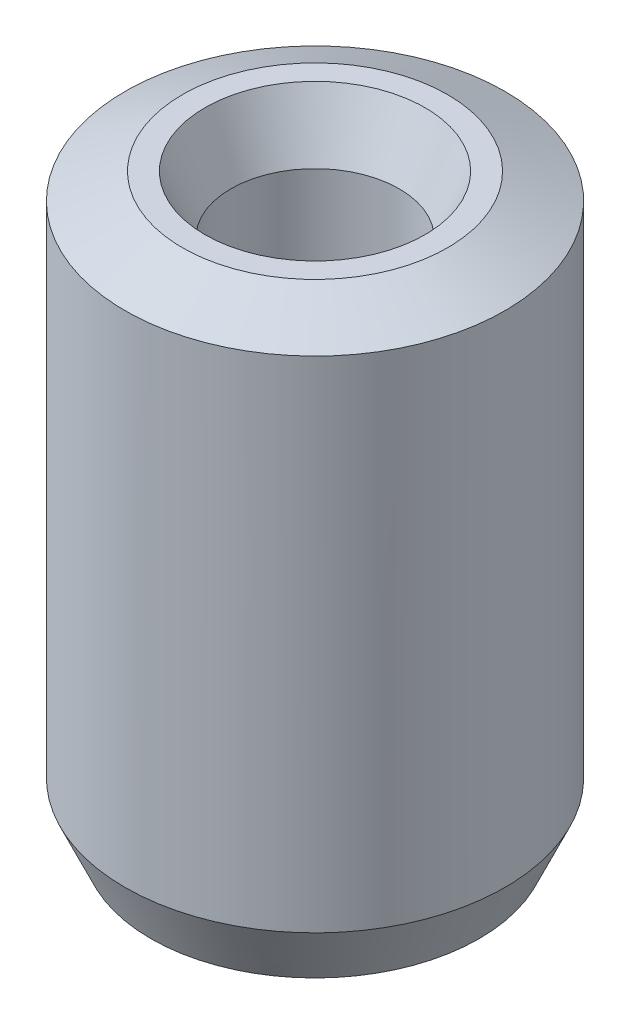
ISO-10303-21;
HEADER;
FILE_DESCRIPTION(('STEP AP214'),'2;1');
FILE_NAME('part.step','',(''),(''),'','','');
FILE_SCHEMA(('AUTOMOTIVE_DESIGN { 1 0 10303 214 1 1 1 1 }'));
ENDSEC;
DATA;
#1=APPLICATION_CONTEXT('core data for automotive mechanical design processes');
#2=APPLICATION_PROTOCOL_DEFINITION('international standard','automotive_design',2000,#1);
#3=PRODUCT_CONTEXT('',#1,'mechanical');
#4=PRODUCT('Part','Part','',(#3));
#5=PRODUCT_RELATED_PRODUCT_CATEGORY('part','',(#4));
#6=PRODUCT_DEFINITION_FORMATION('','',#4);
#7=PRODUCT_DEFINITION_CONTEXT('part definition',#1,'design');
#8=PRODUCT_DEFINITION('design','',#6,#7);
#9=PRODUCT_DEFINITION_SHAPE('','',#8);
#10=(LENGTH_UNIT() NAMED_UNIT(*) SI_UNIT(.MILLI.,.METRE.));
#11=(NAMED_UNIT(*) PLANE_ANGLE_UNIT() SI_UNIT($,.RADIAN.));
#12=(NAMED_UNIT(*) SI_UNIT($,.STERADIAN.) SOLID_ANGLE_UNIT());
#13=UNCERTAINTY_MEASURE_WITH_UNIT(LENGTH_MEASURE(1.E-05),#10,'distance_accuracy_value','');
#14=(GEOMETRIC_REPRESENTATION_CONTEXT(3) GLOBAL_UNCERTAINTY_ASSIGNED_CONTEXT((#13)) GLOBAL_UNIT_ASSIGNED_CONTEXT((#10,
#11,#12)) REPRESENTATION_CONTEXT('',''));
#15=CARTESIAN_POINT('',(0.,0.,0.));
#16=DIRECTION('',(0.,0.,1.));
#17=DIRECTION('',(1.,0.,0.));
#18=AXIS2_PLACEMENT_3D('',#15,#16,#17);
#19=CARTESIAN_POINT('',(0.,84.3537558996951,0.));
#20=DIRECTION('',(0.,-1.,0.));
#21=DIRECTION('',(0.,0.,-1.));
#22=AXIS2_PLACEMENT_3D('',#19,#20,#21);
#23=CYLINDRICAL_SURFACE('',#22,27.5);
#24=CARTESIAN_POINT('',(0.,8.29972185055879,0.));
#25=DIRECTION('',(0.,1.,0.));
#26=DIRECTION('',(0.,0.,1.));
#27=AXIS2_PLACEMENT_3D('',#24,#25,#26);
#28=CIRCLE('',#27,27.5);
#29=CARTESIAN_POINT('',(0.,8.29972185055879,27.5));
#30=VERTEX_POINT('',#29);
#31=EDGE_CURVE('E10',#30,#30,#28,.T.);
#32=ORIENTED_EDGE('',*,*,#31,.T.);
#33=EDGE_LOOP('',(#32));
#34=FACE_BOUND('',#33,.T.);
#35=CARTESIAN_POINT('',(0.,80.6112224634863,0.));
#36=DIRECTION('',(0.,1.,0.));
#37=DIRECTION('',(0.,0.,1.));
#38=AXIS2_PLACEMENT_3D('',#35,#36,#37);
#39=CIRCLE('',#38,27.5);
#40=CARTESIAN_POINT('',(0.,80.6112224634863,-27.5));
#41=VERTEX_POINT('',#40);
#42=EDGE_CURVE('E50',#41,#41,#39,.F.);
#43=ORIENTED_EDGE('',*,*,#42,.T.);
#44=EDGE_LOOP('',(#43));
#45=FACE_BOUND('',#44,.T.);
#46=ADVANCED_FACE('F39',(#34,#45),#23,.T.);
#47=CARTESIAN_POINT('',(0.,84.3537558996951,0.));
#48=DIRECTION('',(0.,1.,0.));
#49=DIRECTION('',(0.,0.,1.));
#50=AXIS2_PLACEMENT_3D('',#47,#48,#49);
#51=PLANE('',#50);
#52=CARTESIAN_POINT('',(0.,84.3537558996951,0.));
#53=DIRECTION('',(0.,1.,0.));
#54=DIRECTION('',(0.,0.,1.));
#55=AXIS2_PLACEMENT_3D('',#52,#53,#54);
#56=CIRCLE('',#55,15.9318125522264);
#57=CARTESIAN_POINT('',(0.,84.3537558996951,15.9318125522264));
#58=VERTEX_POINT('',#57);
#59=EDGE_CURVE('E58',#58,#58,#56,.F.);
#60=ORIENTED_EDGE('',*,*,#59,.T.);
#61=EDGE_LOOP('',(#60));
#62=FACE_BOUND('',#61,.T.);
#63=CARTESIAN_POINT('',(0.,84.3537558996951,0.));
#64=DIRECTION('',(0.,1.,0.));
#65=DIRECTION('',(0.,0.,1.));
#66=AXIS2_PLACEMENT_3D('',#63,#64,#65);
#67=CIRCLE('',#66,19.2002781494412);
#68=CARTESIAN_POINT('',(0.,84.3537558996951,-19.2002781494412));
#69=VERTEX_POINT('',#68);
#70=EDGE_CURVE('E61',#69,#69,#67,.T.);
#71=ORIENTED_EDGE('',*,*,#70,.T.);
#72=EDGE_LOOP('',(#71));
#73=FACE_BOUND('',#72,.T.);
#74=ADVANCED_FACE('F88',(#62,#73),#51,.T.);
#75=CARTESIAN_POINT('',(0.,0.,0.));
#76=DIRECTION('',(0.,1.,0.));
#77=DIRECTION('',(0.,0.,1.));
#78=AXIS2_PLACEMENT_3D('',#75,#76,#77);
#79=PLANE('',#78);
#80=CARTESIAN_POINT('',(0.,0.,0.));
#81=DIRECTION('',(0.,1.,0.));
#82=DIRECTION('',(0.,0.,1.));
#83=AXIS2_PLACEMENT_3D('',#80,#81,#82);
#84=CIRCLE('',#83,20.4890009665764);
#85=CARTESIAN_POINT('',(0.,0.,-20.4890009665764));
#86=VERTEX_POINT('',#85);
#87=EDGE_CURVE('E51',#86,#86,#84,.T.);
#88=ORIENTED_EDGE('',*,*,#87,.T.);
#89=EDGE_LOOP('',(#88));
#90=FACE_BOUND('',#89,.T.);
#91=CARTESIAN_POINT('',(0.,0.,0.));
#92=DIRECTION('',(0.,1.,0.));
#93=DIRECTION('',(0.,0.,1.));
#94=AXIS2_PLACEMENT_3D('',#91,#92,#93);
#95=CIRCLE('',#94,23.7574665637912);
#96=CARTESIAN_POINT('',(0.,0.,23.7574665637912));
#97=VERTEX_POINT('',#96);
#98=EDGE_CURVE('E54',#97,#97,#95,.F.);
#99=ORIENTED_EDGE('',*,*,#98,.T.);
#100=EDGE_LOOP('',(#99));
#101=FACE_BOUND('',#100,.T.);
#102=ADVANCED_FACE('F83',(#90,#101),#79,.F.);
#103=CARTESIAN_POINT('',(0.,84.3537558996951,0.));
#104=DIRECTION('',(0.,-1.,0.));
#105=DIRECTION('',(0.,0.,-1.));
#106=AXIS2_PLACEMENT_3D('',#103,#104,#105);
#107=CYLINDRICAL_SURFACE('',#106,12.1892791160176);
#108=CARTESIAN_POINT('',(0.,76.0540340491363,0.));
#109=DIRECTION('',(0.,1.,0.));
#110=DIRECTION('',(0.,0.,1.));
#111=AXIS2_PLACEMENT_3D('',#108,#109,#110);
#112=CIRCLE('',#111,12.1892791160176);
#113=CARTESIAN_POINT('',(0.,76.0540340491363,12.1892791160176));
#114=VERTEX_POINT('',#113);
#115=EDGE_CURVE('E67',#114,#114,#112,.T.);
#116=ORIENTED_EDGE('',*,*,#115,.T.);
#117=EDGE_LOOP('',(#116));
#118=FACE_BOUND('',#117,.T.);
#119=CARTESIAN_POINT('',(0.,3.7425334362088,0.));
#120=DIRECTION('',(0.,1.,0.));
#121=DIRECTION('',(0.,0.,1.));
#122=AXIS2_PLACEMENT_3D('',#119,#120,#121);
#123=CIRCLE('',#122,12.1892791160176);
#124=CARTESIAN_POINT('',(0.,3.7425334362088,-12.1892791160176));
#125=VERTEX_POINT('',#124);
#126=EDGE_CURVE('E69',#125,#125,#123,.F.);
#127=ORIENTED_EDGE('',*,*,#126,.T.);
#128=EDGE_LOOP('',(#127));
#129=FACE_BOUND('',#128,.T.);
#130=ADVANCED_FACE('F71',(#118,#129),#107,.F.);
#131=CARTESIAN_POINT('',(0.,76.0540340491363,0.));
#132=DIRECTION('',(0.,1.,0.));
#133=DIRECTION('',(0.,0.,1.));
#134=AXIS2_PLACEMENT_3D('',#131,#132,#133);
#135=CONICAL_SURFACE('',#134,12.1892791160176,0.423621024279355);
#136=ORIENTED_EDGE('',*,*,#59,.F.);
#137=EDGE_LOOP('',(#136));
#138=FACE_BOUND('',#137,.T.);
#139=ORIENTED_EDGE('',*,*,#115,.F.);
#140=EDGE_LOOP('',(#139));
#141=FACE_BOUND('',#140,.T.);
#142=ADVANCED_FACE('F77',(#138,#141),#135,.F.);
#143=CARTESIAN_POINT('',(0.,0.,0.));
#144=DIRECTION('',(0.,-1.,0.));
#145=DIRECTION('',(0.,0.,-1.));
#146=AXIS2_PLACEMENT_3D('',#143,#144,#145);
#147=CONICAL_SURFACE('',#146,20.4890009665764,1.14717530251554);
#148=CARTESIAN_POINT('',(0.,3.7425334362088,-12.1892791160176));
#149=CARTESIAN_POINT('',(0.,3.70354871291496,-12.2757345519609));
#150=CARTESIAN_POINT('',(0.,3.66456398962111,-12.3621899879042));
#151=CARTESIAN_POINT('',(0.,3.58659454303343,-12.5351008597909));
#152=CARTESIAN_POINT('',(0.,3.54760981973959,-12.6215562957342));
#153=CARTESIAN_POINT('',(0.,3.46964037315191,-12.7944671676208));
#154=CARTESIAN_POINT('',(0.,3.43065564985806,-12.8809226035641));
#155=CARTESIAN_POINT('',(0.,3.35268620327038,-13.0538334754508));
#156=CARTESIAN_POINT('',(0.,3.31370147997654,-13.1402889113941));
#157=CARTESIAN_POINT('',(0.,3.23573203338886,-13.3131997832807));
#158=CARTESIAN_POINT('',(0.,3.19674731009501,-13.3996552192241));
#159=CARTESIAN_POINT('',(0.,3.11877786350733,-13.5725660911107));
#160=CARTESIAN_POINT('',(0.,3.07979314021349,-13.659021527054));
#161=CARTESIAN_POINT('',(0.,3.00182369362581,-13.8319323989407));
#162=CARTESIAN_POINT('',(0.,2.96283897033196,-13.918387834884));
#163=CARTESIAN_POINT('',(0.,2.88486952374428,-14.0912987067706));
#164=CARTESIAN_POINT('',(0.,2.84588480045044,-14.177754142714));
#165=CARTESIAN_POINT('',(0.,2.76791535386276,-14.3506650146006));
#166=CARTESIAN_POINT('',(0.,2.72893063056891,-14.4371204505439));
#167=CARTESIAN_POINT('',(0.,2.65096118398123,-14.6100313224306));
#168=CARTESIAN_POINT('',(0.,2.61197646068739,-14.6964867583739));
#169=CARTESIAN_POINT('',(0.,2.53400701409971,-14.8693976302605));
#170=CARTESIAN_POINT('',(0.,2.49502229080586,-14.9558530662038));
#171=CARTESIAN_POINT('',(0.,2.41705284421818,-15.1287639380905));
#172=CARTESIAN_POINT('',(0.,2.37806812092434,-15.2152193740338));
#173=CARTESIAN_POINT('',(0.,2.30009867433666,-15.3881302459204));
#174=CARTESIAN_POINT('',(0.,2.26111395104281,-15.4745856818638));
#175=CARTESIAN_POINT('',(0.,2.18314450445513,-15.6474965537504));
#176=CARTESIAN_POINT('',(0.,2.14415978116129,-15.7339519896937));
#177=CARTESIAN_POINT('',(0.,2.06619033457361,-15.9068628615804));
#178=CARTESIAN_POINT('',(0.,2.02720561127977,-15.9933182975237));
#179=CARTESIAN_POINT('',(0.,1.94923616469208,-16.1662291694103));
#180=CARTESIAN_POINT('',(0.,1.91025144139824,-16.2526846053537));
#181=CARTESIAN_POINT('',(0.,1.83228199481056,-16.4255954772403));
#182=CARTESIAN_POINT('',(0.,1.79329727151672,-16.5120509131836));
#183=CARTESIAN_POINT('',(0.,1.71532782492903,-16.6849617850703));
#184=CARTESIAN_POINT('',(0.,1.67634310163519,-16.7714172210136));
#185=CARTESIAN_POINT('',(0.,1.59837365504751,-16.9443280929002));
#186=CARTESIAN_POINT('',(0.,1.55938893175367,-17.0307835288435));
#187=CARTESIAN_POINT('',(0.,1.48141948516598,-17.2036944007302));
#188=CARTESIAN_POINT('',(0.,1.44243476187214,-17.2901498366735));
#189=CARTESIAN_POINT('',(0.,1.36446531528446,-17.4630607085601));
#190=CARTESIAN_POINT('',(0.,1.32548059199062,-17.5495161445035));
#191=CARTESIAN_POINT('',(0.,1.24751114540293,-17.7224270163901));
#192=CARTESIAN_POINT('',(0.,1.20852642210909,-17.8088824523334));
#193=CARTESIAN_POINT('',(0.,1.13055697552141,-17.9817933242201));
#194=CARTESIAN_POINT('',(0.,1.09157225222757,-18.0682487601634));
#195=CARTESIAN_POINT('',(0.,1.01360280563988,-18.24115963205));
#196=CARTESIAN_POINT('',(0.,0.974618082346041,-18.3276150679933));
#197=CARTESIAN_POINT('',(0.,0.896648635758358,-18.50052593988));
#198=CARTESIAN_POINT('',(0.,0.857663912464516,-18.5869813758233));
#199=CARTESIAN_POINT('',(0.,0.779694465876832,-18.75989224771));
#200=CARTESIAN_POINT('',(0.,0.740709742582991,-18.8463476836533));
#201=CARTESIAN_POINT('',(0.,0.662740295995308,-19.0192585555399));
#202=CARTESIAN_POINT('',(0.,0.623755572701466,-19.1057139914832));
#203=CARTESIAN_POINT('',(0.,0.545786126113783,-19.2786248633699));
#204=CARTESIAN_POINT('',(0.,0.506801402819941,-19.3650802993132));
#205=CARTESIAN_POINT('',(0.,0.428831956232258,-19.5379911711998));
#206=CARTESIAN_POINT('',(0.,0.389847232938416,-19.6244466071432));
#207=CARTESIAN_POINT('',(0.,0.311877786350733,-19.7973574790298));
#208=CARTESIAN_POINT('',(0.,0.272893063056892,-19.8838129149731));
#209=CARTESIAN_POINT('',(0.,0.194923616469208,-20.0567237868598));
#210=CARTESIAN_POINT('',(0.,0.155938893175367,-20.1431792228031));
#211=CARTESIAN_POINT('',(0.,0.0779694465876828,-20.3160900946897));
#212=CARTESIAN_POINT('',(0.,0.0389847232938409,-20.402545530633));
#213=CARTESIAN_POINT('',(0.,0.,-20.4890009665764));
#214=B_SPLINE_CURVE_WITH_KNOTS('',3,(#148,#149,#150,#151,#152,#153,#154,#155,#156,#157,#158,
#159,#160,#161,#162,#163,#164,#165,#166,#167,#168,#169,#170,#171,#172,#173,#174,#175,#176,#177,
#178,#179,#180,#181,#182,#183,#184,#185,#186,#187,#188,#189,#190,#191,#192,#193,#194,#195,#196,
#197,#198,#199,#200,#201,#202,#203,#204,#205,#206,#207,#208,#209,#210,#211,#212,#213),
.UNSPECIFIED.,.F.,.F.,(4,2,2,2,2,2,2,2,2,2,2,2,2,2,2,2,2,2,2,2,2,2,2,2,2,2,2,2,2,2,2,2,4),(0.,
0.284515657723831,0.56903131544766,0.85354697317149,1.13806263089532,1.42257828861915,
1.70709394634298,1.99160960406681,2.27612526179064,2.56064091951447,2.8451565772383,
3.12967223496213,3.41418789268596,3.69870355040978,3.98321920813361,4.26773486585744,
4.55225052358127,4.8367661813051,5.12128183902893,5.40579749675276,5.69031315447659,
5.97482881220042,6.25934446992425,6.54386012764808,6.82837578537191,7.11289144309574,
7.39740710081957,7.6819227585434,7.96643841626722,8.25095407399105,8.53546973171489,
8.81998538943871,9.10450104716254),.UNSPECIFIED.);
#215=EDGE_CURVE('BSEAM73',#125,#86,#214,.T.);
#216=ORIENTED_EDGE('',*,*,#126,.F.);
#217=ORIENTED_EDGE('',*,*,#87,.F.);
#218=ORIENTED_EDGE('',*,*,#215,.T.);
#219=ORIENTED_EDGE('',*,*,#215,.F.);
#220=EDGE_LOOP('',(#216,#218,#217,#219));
#221=FACE_BOUND('',#220,.T.);
#222=ADVANCED_FACE('F73',(#221),#147,.F.);
#223=CARTESIAN_POINT('',(0.,8.29972185055879,0.));
#224=DIRECTION('',(0.,1.,0.));
#225=DIRECTION('',(0.,0.,1.));
#226=AXIS2_PLACEMENT_3D('',#223,#224,#225);
#227=CONICAL_SURFACE('',#226,27.5,0.423621024279354);
#228=ORIENTED_EDGE('',*,*,#98,.F.);
#229=EDGE_LOOP('',(#228));
#230=FACE_BOUND('',#229,.T.);
#231=ORIENTED_EDGE('',*,*,#31,.F.);
#232=EDGE_LOOP('',(#231));
#233=FACE_BOUND('',#232,.T.);
#234=ADVANCED_FACE('F76',(#230,#233),#227,.T.);
#235=CARTESIAN_POINT('',(0.,84.3537558996951,0.));
#236=DIRECTION('',(0.,-1.,0.));
#237=DIRECTION('',(0.,0.,-1.));
#238=AXIS2_PLACEMENT_3D('',#235,#236,#237);
#239=CONICAL_SURFACE('',#238,19.2002781494412,1.14717530251554);
#240=CARTESIAN_POINT('',(0.,80.6112224634863,-27.5));
#241=CARTESIAN_POINT('',(0.,80.6502071867801,-27.4135445640567));
#242=CARTESIAN_POINT('',(0.,80.689191910074,-27.3270891281134));
#243=CARTESIAN_POINT('',(0.,80.7671613566617,-27.1541782562267));
#244=CARTESIAN_POINT('',(0.,80.8061460799555,-27.0677228202834));
#245=CARTESIAN_POINT('',(0.,80.8841155265432,-26.8948119483968));
#246=CARTESIAN_POINT('',(0.,80.923100249837,-26.8083565124535));
#247=CARTESIAN_POINT('',(0.,81.0010696964247,-26.6354456405668));
#248=CARTESIAN_POINT('',(0.,81.0400544197186,-26.5489902046235));
#249=CARTESIAN_POINT('',(0.,81.1180238663062,-26.3760793327369));
#250=CARTESIAN_POINT('',(0.,81.1570085896001,-26.2896238967935));
#251=CARTESIAN_POINT('',(0.,81.2349780361877,-26.1167130249069));
#252=CARTESIAN_POINT('',(0.,81.2739627594816,-26.0302575889636));
#253=CARTESIAN_POINT('',(0.,81.3519322060693,-25.8573467170769));
#254=CARTESIAN_POINT('',(0.,81.3909169293631,-25.7708912811336));
#255=CARTESIAN_POINT('',(0.,81.4688863759508,-25.597980409247));
#256=CARTESIAN_POINT('',(0.,81.5078710992447,-25.5115249733036));
#257=CARTESIAN_POINT('',(0.,81.5858405458323,-25.338614101417));
#258=CARTESIAN_POINT('',(0.,81.6248252691262,-25.2521586654737));
#259=CARTESIAN_POINT('',(0.,81.7027947157139,-25.079247793587));
#260=CARTESIAN_POINT('',(0.,81.7417794390077,-24.9927923576437));
#261=CARTESIAN_POINT('',(0.,81.8197488855954,-24.8198814857571));
#262=CARTESIAN_POINT('',(0.,81.8587336088892,-24.7334260498138));
#263=CARTESIAN_POINT('',(0.,81.9367030554769,-24.5605151779271));
#264=CARTESIAN_POINT('',(0.,81.9756877787707,-24.4740597419838));
#265=CARTESIAN_POINT('',(0.,82.0536572253584,-24.3011488700971));
#266=CARTESIAN_POINT('',(0.,82.0926419486523,-24.2146934341538));
#267=CARTESIAN_POINT('',(0.,82.17061139524,-24.0417825622672));
#268=CARTESIAN_POINT('',(0.,82.2095961185338,-23.9553271263239));
#269=CARTESIAN_POINT('',(0.,82.2875655651215,-23.7824162544372));
#270=CARTESIAN_POINT('',(0.,82.3265502884153,-23.6959608184939));
#271=CARTESIAN_POINT('',(0.,82.404519735003,-23.5230499466073));
#272=CARTESIAN_POINT('',(0.,82.4435044582968,-23.4365945106639));
#273=CARTESIAN_POINT('',(0.,82.5214739048845,-23.2636836387773));
#274=CARTESIAN_POINT('',(0.,82.5604586281784,-23.177228202834));
#275=CARTESIAN_POINT('',(0.,82.6384280747661,-23.0043173309473));
#276=CARTESIAN_POINT('',(0.,82.6774127980599,-22.917861895004));
#277=CARTESIAN_POINT('',(0.,82.7553822446476,-22.7449510231174));
#278=CARTESIAN_POINT('',(0.,82.7943669679414,-22.6584955871741));
#279=CARTESIAN_POINT('',(0.,82.8723364145291,-22.4855847152874));
#280=CARTESIAN_POINT('',(0.,82.9113211378229,-22.3991292793441));
#281=CARTESIAN_POINT('',(0.,82.9892905844106,-22.2262184074575));
#282=CARTESIAN_POINT('',(0.,83.0282753077045,-22.1397629715141));
#283=CARTESIAN_POINT('',(0.,83.1062447542922,-21.9668520996275));
#284=CARTESIAN_POINT('',(0.,83.145229477586,-21.8803966636842));
#285=CARTESIAN_POINT('',(0.,83.2231989241737,-21.7074857917975));
#286=CARTESIAN_POINT('',(0.,83.2621836474675,-21.6210303558542));
#287=CARTESIAN_POINT('',(0.,83.3401530940552,-21.4481194839676));
#288=CARTESIAN_POINT('',(0.,83.379137817349,-21.3616640480242));
#289=CARTESIAN_POINT('',(0.,83.4571072639367,-21.1887531761376));
#290=CARTESIAN_POINT('',(0.,83.4960919872306,-21.1022977401943));
#291=CARTESIAN_POINT('',(0.,83.5740614338183,-20.9293868683076));
#292=CARTESIAN_POINT('',(0.,83.6130461571121,-20.8429314323643));
#293=CARTESIAN_POINT('',(0.,83.6910156036998,-20.6700205604777));
#294=CARTESIAN_POINT('',(0.,83.7300003269936,-20.5835651245344));
#295=CARTESIAN_POINT('',(0.,83.8079697735813,-20.4106542526477));
#296=CARTESIAN_POINT('',(0.,83.8469544968752,-20.3241988167044));
#297=CARTESIAN_POINT('',(0.,83.9249239434628,-20.1512879448178));
#298=CARTESIAN_POINT('',(0.,83.9639086667567,-20.0648325088744));
#299=CARTESIAN_POINT('',(0.,84.0418781133444,-19.8919216369878));
#300=CARTESIAN_POINT('',(0.,84.0808628366382,-19.8054662010445));
#301=CARTESIAN_POINT('',(0.,84.1588322832259,-19.6325553291578));
#302=CARTESIAN_POINT('',(0.,84.1978170065197,-19.5460998932145));
#303=CARTESIAN_POINT('',(0.,84.2757864531074,-19.3731890213279));
#304=CARTESIAN_POINT('',(0.,84.3147711764013,-19.2867335853845));
#305=CARTESIAN_POINT('',(0.,84.3537558996951,-19.2002781494412));
#306=B_SPLINE_CURVE_WITH_KNOTS('',3,(#240,#241,#242,#243,#244,#245,#246,#247,#248,#249,#250,
#251,#252,#253,#254,#255,#256,#257,#258,#259,#260,#261,#262,#263,#264,#265,#266,#267,#268,#269,
#270,#271,#272,#273,#274,#275,#276,#277,#278,#279,#280,#281,#282,#283,#284,#285,#286,#287,#288,
#289,#290,#291,#292,#293,#294,#295,#296,#297,#298,#299,#300,#301,#302,#303,#304,#305),
.UNSPECIFIED.,.F.,.F.,(4,2,2,2,2,2,2,2,2,2,2,2,2,2,2,2,2,2,2,2,2,2,2,2,2,2,2,2,2,2,2,2,4),(0.,
0.284515657723829,0.569031315447658,0.85354697317149,1.13806263089532,1.42257828861914,
1.70709394634298,1.9916096040668,2.27612526179064,2.56064091951447,2.84515657723829,
3.12967223496212,3.41418789268595,3.69870355040978,3.98321920813361,4.26773486585744,
4.55225052358127,4.8367661813051,5.12128183902893,5.40579749675276,5.69031315447659,
5.97482881220042,6.25934446992425,6.54386012764807,6.8283757853719,7.11289144309574,
7.39740710081957,7.6819227585434,7.96643841626722,8.25095407399105,8.53546973171488,
8.81998538943871,9.10450104716254),.UNSPECIFIED.);
#307=EDGE_CURVE('BSEAM45',#41,#69,#306,.T.);
#308=ORIENTED_EDGE('',*,*,#42,.F.);
#309=ORIENTED_EDGE('',*,*,#70,.F.);
#310=ORIENTED_EDGE('',*,*,#307,.T.);
#311=ORIENTED_EDGE('',*,*,#307,.F.);
#312=EDGE_LOOP('',(#308,#310,#309,#311));
#313=FACE_BOUND('',#312,.T.);
#314=ADVANCED_FACE('F45',(#313),#239,.T.);
#315=CLOSED_SHELL('',(#46,#74,#102,#130,#142,#222,#234,#314));
#316=MANIFOLD_SOLID_BREP('B2',#315);
#317=ADVANCED_BREP_SHAPE_REPRESENTATION('',(#18,#316),#14);
#318=SHAPE_DEFINITION_REPRESENTATION(#9,#317);
ENDSEC;
END-ISO-10303-21;
